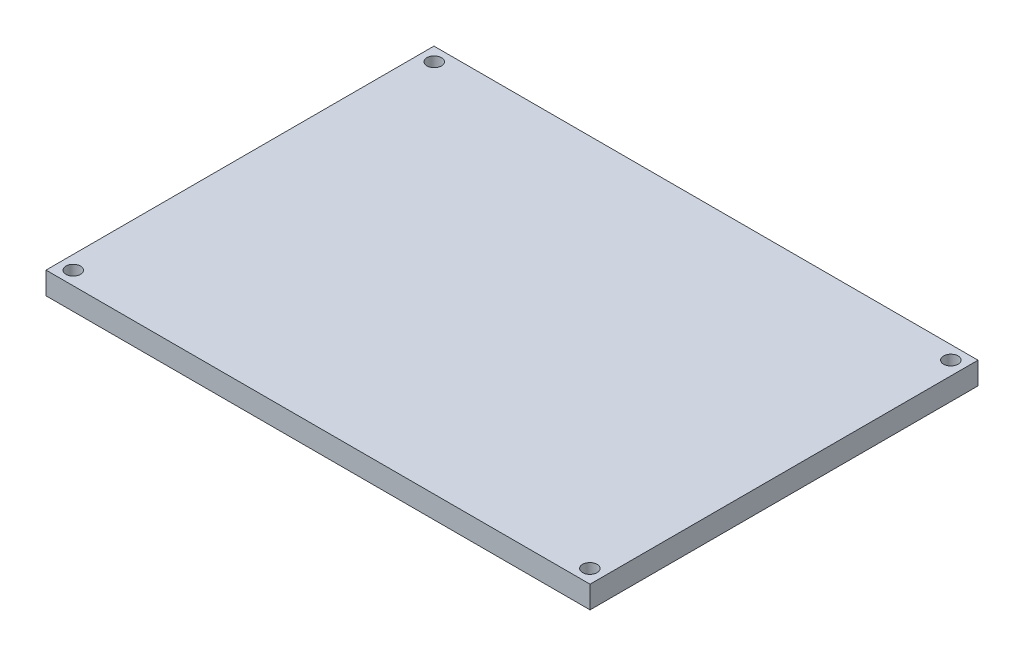
ISO-10303-21;
HEADER;
FILE_DESCRIPTION(('STEP AP214'),'2;1');
FILE_NAME('part.step','',(''),(''),'','','');
FILE_SCHEMA(('AUTOMOTIVE_DESIGN { 1 0 10303 214 1 1 1 1 }'));
ENDSEC;
DATA;
#1=APPLICATION_CONTEXT('core data for automotive mechanical design processes');
#2=APPLICATION_PROTOCOL_DEFINITION('international standard','automotive_design',2000,#1);
#3=PRODUCT_CONTEXT('',#1,'mechanical');
#4=PRODUCT('Part','Part','',(#3));
#5=PRODUCT_RELATED_PRODUCT_CATEGORY('part','',(#4));
#6=PRODUCT_DEFINITION_FORMATION('','',#4);
#7=PRODUCT_DEFINITION_CONTEXT('part definition',#1,'design');
#8=PRODUCT_DEFINITION('design','',#6,#7);
#9=PRODUCT_DEFINITION_SHAPE('','',#8);
#10=(LENGTH_UNIT() NAMED_UNIT(*) SI_UNIT(.MILLI.,.METRE.));
#11=(NAMED_UNIT(*) PLANE_ANGLE_UNIT() SI_UNIT($,.RADIAN.));
#12=(NAMED_UNIT(*) SI_UNIT($,.STERADIAN.) SOLID_ANGLE_UNIT());
#13=UNCERTAINTY_MEASURE_WITH_UNIT(LENGTH_MEASURE(1.E-05),#10,'distance_accuracy_value','');
#14=(GEOMETRIC_REPRESENTATION_CONTEXT(3) GLOBAL_UNCERTAINTY_ASSIGNED_CONTEXT((#13)) GLOBAL_UNIT_ASSIGNED_CONTEXT((#10,
#11,#12)) REPRESENTATION_CONTEXT('',''));
#15=CARTESIAN_POINT('',(0.,0.,0.));
#16=DIRECTION('',(0.,0.,1.));
#17=DIRECTION('',(1.,0.,0.));
#18=AXIS2_PLACEMENT_3D('',#15,#16,#17);
#19=CARTESIAN_POINT('',(0.,5.,0.));
#20=DIRECTION('',(0.,-1.,0.));
#21=DIRECTION('',(0.,0.,-1.));
#22=AXIS2_PLACEMENT_3D('',#19,#20,#21);
#23=PLANE('',#22);
#24=DIRECTION('',(0.,0.,-1.));
#25=VECTOR('',#24,1.);
#26=CARTESIAN_POINT('',(61.,5.,43.5));
#27=LINE('',#26,#25);
#28=CARTESIAN_POINT('',(61.,5.,43.5));
#29=VERTEX_POINT('',#28);
#30=CARTESIAN_POINT('',(61.,5.,-43.5));
#31=VERTEX_POINT('',#30);
#32=EDGE_CURVE('E91',#29,#31,#27,.T.);
#33=ORIENTED_EDGE('',*,*,#32,.T.);
#34=DIRECTION('',(-1.,0.,0.));
#35=VECTOR('',#34,1.);
#36=CARTESIAN_POINT('',(-61.,5.,-43.5));
#37=LINE('',#36,#35);
#38=CARTESIAN_POINT('',(-61.,5.,-43.5));
#39=VERTEX_POINT('',#38);
#40=EDGE_CURVE('E86',#31,#39,#37,.T.);
#41=ORIENTED_EDGE('',*,*,#40,.T.);
#42=DIRECTION('',(0.,0.,1.));
#43=VECTOR('',#42,1.);
#44=CARTESIAN_POINT('',(-61.,5.,43.5));
#45=LINE('',#44,#43);
#46=CARTESIAN_POINT('',(-61.,5.,43.5));
#47=VERTEX_POINT('',#46);
#48=EDGE_CURVE('E89',#39,#47,#45,.T.);
#49=ORIENTED_EDGE('',*,*,#48,.T.);
#50=DIRECTION('',(1.,0.,0.));
#51=VECTOR('',#50,1.);
#52=CARTESIAN_POINT('',(-61.,5.,43.5));
#53=LINE('',#52,#51);
#54=EDGE_CURVE('E56',#47,#29,#53,.T.);
#55=ORIENTED_EDGE('',*,*,#54,.T.);
#56=EDGE_LOOP('',(#33,#41,#49,#55));
#57=FACE_BOUND('',#56,.T.);
#58=CARTESIAN_POINT('',(57.925,5.,-40.475));
#59=DIRECTION('',(0.,1.,0.));
#60=DIRECTION('',(0.,0.,1.));
#61=AXIS2_PLACEMENT_3D('',#58,#59,#60);
#62=CIRCLE('',#61,1.625);
#63=CARTESIAN_POINT('',(57.925,5.,-38.85));
#64=VERTEX_POINT('',#63);
#65=EDGE_CURVE('E106',#64,#64,#62,.T.);
#66=ORIENTED_EDGE('',*,*,#65,.F.);
#67=EDGE_LOOP('',(#66));
#68=FACE_BOUND('',#67,.T.);
#69=CARTESIAN_POINT('',(-57.9250000000003,5.,-40.4749999999996));
#70=DIRECTION('',(0.,1.,0.));
#71=DIRECTION('',(0.,0.,-1.));
#72=AXIS2_PLACEMENT_3D('',#69,#70,#71);
#73=CIRCLE('',#72,1.62500000000002);
#74=CARTESIAN_POINT('',(-57.9250000000003,5.,-42.0999999999996));
#75=VERTEX_POINT('',#74);
#76=EDGE_CURVE('E121',#75,#75,#73,.T.);
#77=ORIENTED_EDGE('',*,*,#76,.F.);
#78=EDGE_LOOP('',(#77));
#79=FACE_BOUND('',#78,.T.);
#80=CARTESIAN_POINT('',(-57.9250000000003,5.,40.4749999999995));
#81=DIRECTION('',(0.,1.,0.));
#82=DIRECTION('',(0.,0.,1.));
#83=AXIS2_PLACEMENT_3D('',#80,#81,#82);
#84=CIRCLE('',#83,1.62500000000002);
#85=CARTESIAN_POINT('',(-57.9250000000003,5.,42.0999999999996));
#86=VERTEX_POINT('',#85);
#87=EDGE_CURVE('E127',#86,#86,#84,.T.);
#88=ORIENTED_EDGE('',*,*,#87,.F.);
#89=EDGE_LOOP('',(#88));
#90=FACE_BOUND('',#89,.T.);
#91=CARTESIAN_POINT('',(57.925,5.,40.475));
#92=DIRECTION('',(0.,1.,0.));
#93=DIRECTION('',(0.,0.,-1.));
#94=AXIS2_PLACEMENT_3D('',#91,#92,#93);
#95=CIRCLE('',#94,1.625);
#96=CARTESIAN_POINT('',(57.925,5.,38.85));
#97=VERTEX_POINT('',#96);
#98=EDGE_CURVE('E133',#97,#97,#95,.T.);
#99=ORIENTED_EDGE('',*,*,#98,.F.);
#100=EDGE_LOOP('',(#99));
#101=FACE_BOUND('',#100,.T.);
#102=ADVANCED_FACE('F39',(#57,#68,#79,#90,#101),#23,.F.);
#103=CARTESIAN_POINT('',(0.,0.,0.));
#104=DIRECTION('',(0.,-1.,0.));
#105=DIRECTION('',(0.,0.,-1.));
#106=AXIS2_PLACEMENT_3D('',#103,#104,#105);
#107=PLANE('',#106);
#108=CARTESIAN_POINT('',(-57.9250000000003,0.,40.4749999999995));
#109=DIRECTION('',(0.,1.,0.));
#110=DIRECTION('',(0.,0.,1.));
#111=AXIS2_PLACEMENT_3D('',#108,#109,#110);
#112=CIRCLE('',#111,1.62500000000002);
#113=CARTESIAN_POINT('',(-57.9250000000003,0.,42.0999999999996));
#114=VERTEX_POINT('',#113);
#115=EDGE_CURVE('E130',#114,#114,#112,.T.);
#116=ORIENTED_EDGE('',*,*,#115,.T.);
#117=EDGE_LOOP('',(#116));
#118=FACE_BOUND('',#117,.T.);
#119=CARTESIAN_POINT('',(57.925,0.,-40.475));
#120=DIRECTION('',(0.,1.,0.));
#121=DIRECTION('',(0.,0.,1.));
#122=AXIS2_PLACEMENT_3D('',#119,#120,#121);
#123=CIRCLE('',#122,1.625);
#124=CARTESIAN_POINT('',(57.925,0.,-38.85));
#125=VERTEX_POINT('',#124);
#126=EDGE_CURVE('E118',#125,#125,#123,.T.);
#127=ORIENTED_EDGE('',*,*,#126,.T.);
#128=EDGE_LOOP('',(#127));
#129=FACE_BOUND('',#128,.T.);
#130=DIRECTION('',(0.,0.,-1.));
#131=VECTOR('',#130,1.);
#132=CARTESIAN_POINT('',(61.,0.,43.5));
#133=LINE('',#132,#131);
#134=CARTESIAN_POINT('',(61.,0.,43.5));
#135=VERTEX_POINT('',#134);
#136=CARTESIAN_POINT('',(61.,0.,-43.5));
#137=VERTEX_POINT('',#136);
#138=EDGE_CURVE('E103',#135,#137,#133,.T.);
#139=ORIENTED_EDGE('',*,*,#138,.F.);
#140=DIRECTION('',(1.,0.,0.));
#141=VECTOR('',#140,1.);
#142=CARTESIAN_POINT('',(-61.,0.,43.5));
#143=LINE('',#142,#141);
#144=CARTESIAN_POINT('',(-61.,0.,43.5));
#145=VERTEX_POINT('',#144);
#146=EDGE_CURVE('E79',#145,#135,#143,.T.);
#147=ORIENTED_EDGE('',*,*,#146,.F.);
#148=DIRECTION('',(0.,0.,1.));
#149=VECTOR('',#148,1.);
#150=CARTESIAN_POINT('',(-61.,0.,43.5));
#151=LINE('',#150,#149);
#152=CARTESIAN_POINT('',(-61.,0.,-43.5));
#153=VERTEX_POINT('',#152);
#154=EDGE_CURVE('E73',#153,#145,#151,.T.);
#155=ORIENTED_EDGE('',*,*,#154,.F.);
#156=DIRECTION('',(-1.,0.,0.));
#157=VECTOR('',#156,1.);
#158=CARTESIAN_POINT('',(-61.,0.,-43.5));
#159=LINE('',#158,#157);
#160=EDGE_CURVE('E95',#137,#153,#159,.T.);
#161=ORIENTED_EDGE('',*,*,#160,.F.);
#162=EDGE_LOOP('',(#139,#147,#155,#161));
#163=FACE_BOUND('',#162,.T.);
#164=CARTESIAN_POINT('',(-57.9250000000003,0.,-40.4749999999996));
#165=DIRECTION('',(0.,1.,0.));
#166=DIRECTION('',(0.,0.,-1.));
#167=AXIS2_PLACEMENT_3D('',#164,#165,#166);
#168=CIRCLE('',#167,1.62500000000002);
#169=CARTESIAN_POINT('',(-57.9250000000003,0.,-42.0999999999996));
#170=VERTEX_POINT('',#169);
#171=EDGE_CURVE('E124',#170,#170,#168,.T.);
#172=ORIENTED_EDGE('',*,*,#171,.T.);
#173=EDGE_LOOP('',(#172));
#174=FACE_BOUND('',#173,.T.);
#175=CARTESIAN_POINT('',(57.925,0.,40.475));
#176=DIRECTION('',(0.,1.,0.));
#177=DIRECTION('',(0.,0.,-1.));
#178=AXIS2_PLACEMENT_3D('',#175,#176,#177);
#179=CIRCLE('',#178,1.625);
#180=CARTESIAN_POINT('',(57.925,0.,38.85));
#181=VERTEX_POINT('',#180);
#182=EDGE_CURVE('E136',#181,#181,#179,.T.);
#183=ORIENTED_EDGE('',*,*,#182,.T.);
#184=EDGE_LOOP('',(#183));
#185=FACE_BOUND('',#184,.T.);
#186=ADVANCED_FACE('F114',(#118,#129,#163,#174,#185),#107,.T.);
#187=CARTESIAN_POINT('',(61.,5.,43.5));
#188=DIRECTION('',(-1.,0.,0.));
#189=DIRECTION('',(0.,0.,1.));
#190=AXIS2_PLACEMENT_3D('',#187,#188,#189);
#191=PLANE('',#190);
#192=ORIENTED_EDGE('',*,*,#138,.T.);
#193=DIRECTION('',(0.,-1.,0.));
#194=VECTOR('',#193,1.);
#195=CARTESIAN_POINT('',(61.,5.,-43.5));
#196=LINE('',#195,#194);
#197=EDGE_CURVE('E11',#31,#137,#196,.T.);
#198=ORIENTED_EDGE('',*,*,#197,.F.);
#199=ORIENTED_EDGE('',*,*,#32,.F.);
#200=DIRECTION('',(0.,-1.,0.));
#201=VECTOR('',#200,1.);
#202=CARTESIAN_POINT('',(61.,5.,43.5));
#203=LINE('',#202,#201);
#204=EDGE_CURVE('E99',#29,#135,#203,.T.);
#205=ORIENTED_EDGE('',*,*,#204,.T.);
#206=EDGE_LOOP('',(#192,#198,#199,#205));
#207=FACE_BOUND('',#206,.T.);
#208=ADVANCED_FACE('F41',(#207),#191,.F.);
#209=CARTESIAN_POINT('',(-61.,5.,-43.5));
#210=DIRECTION('',(0.,0.,1.));
#211=DIRECTION('',(1.,0.,0.));
#212=AXIS2_PLACEMENT_3D('',#209,#210,#211);
#213=PLANE('',#212);
#214=ORIENTED_EDGE('',*,*,#160,.T.);
#215=DIRECTION('',(0.,-1.,0.));
#216=VECTOR('',#215,1.);
#217=CARTESIAN_POINT('',(-61.,5.,-43.5));
#218=LINE('',#217,#216);
#219=EDGE_CURVE('E48',#39,#153,#218,.T.);
#220=ORIENTED_EDGE('',*,*,#219,.F.);
#221=ORIENTED_EDGE('',*,*,#40,.F.);
#222=ORIENTED_EDGE('',*,*,#197,.T.);
#223=EDGE_LOOP('',(#214,#220,#221,#222));
#224=FACE_BOUND('',#223,.T.);
#225=ADVANCED_FACE('F94',(#224),#213,.F.);
#226=CARTESIAN_POINT('',(-61.,5.,43.5));
#227=DIRECTION('',(1.,0.,0.));
#228=DIRECTION('',(0.,0.,-1.));
#229=AXIS2_PLACEMENT_3D('',#226,#227,#228);
#230=PLANE('',#229);
#231=ORIENTED_EDGE('',*,*,#154,.T.);
#232=DIRECTION('',(0.,-1.,0.));
#233=VECTOR('',#232,1.);
#234=CARTESIAN_POINT('',(-61.,5.,43.5));
#235=LINE('',#234,#233);
#236=EDGE_CURVE('E96',#47,#145,#235,.T.);
#237=ORIENTED_EDGE('',*,*,#236,.F.);
#238=ORIENTED_EDGE('',*,*,#48,.F.);
#239=ORIENTED_EDGE('',*,*,#219,.T.);
#240=EDGE_LOOP('',(#231,#237,#238,#239));
#241=FACE_BOUND('',#240,.T.);
#242=ADVANCED_FACE('F97',(#241),#230,.F.);
#243=CARTESIAN_POINT('',(-61.,5.,43.5));
#244=DIRECTION('',(0.,0.,-1.));
#245=DIRECTION('',(-1.,0.,0.));
#246=AXIS2_PLACEMENT_3D('',#243,#244,#245);
#247=PLANE('',#246);
#248=ORIENTED_EDGE('',*,*,#146,.T.);
#249=ORIENTED_EDGE('',*,*,#204,.F.);
#250=ORIENTED_EDGE('',*,*,#54,.F.);
#251=ORIENTED_EDGE('',*,*,#236,.T.);
#252=EDGE_LOOP('',(#248,#249,#250,#251));
#253=FACE_BOUND('',#252,.T.);
#254=ADVANCED_FACE('F111',(#253),#247,.F.);
#255=CARTESIAN_POINT('',(57.925,5.,-40.475));
#256=DIRECTION('',(0.,-1.,0.));
#257=DIRECTION('',(0.,0.,-1.));
#258=AXIS2_PLACEMENT_3D('',#255,#256,#257);
#259=CYLINDRICAL_SURFACE('',#258,1.625);
#260=ORIENTED_EDGE('',*,*,#65,.T.);
#261=EDGE_LOOP('',(#260));
#262=FACE_BOUND('',#261,.T.);
#263=ORIENTED_EDGE('',*,*,#126,.F.);
#264=EDGE_LOOP('',(#263));
#265=FACE_BOUND('',#264,.T.);
#266=ADVANCED_FACE('F153',(#262,#265),#259,.F.);
#267=CARTESIAN_POINT('',(-57.9250000000003,5.,-40.4749999999996));
#268=DIRECTION('',(0.,-1.,0.));
#269=DIRECTION('',(0.,0.,-1.));
#270=AXIS2_PLACEMENT_3D('',#267,#268,#269);
#271=CYLINDRICAL_SURFACE('',#270,1.62500000000002);
#272=ORIENTED_EDGE('',*,*,#76,.T.);
#273=EDGE_LOOP('',(#272));
#274=FACE_BOUND('',#273,.T.);
#275=ORIENTED_EDGE('',*,*,#171,.F.);
#276=EDGE_LOOP('',(#275));
#277=FACE_BOUND('',#276,.T.);
#278=ADVANCED_FACE('F198',(#274,#277),#271,.F.);
#279=CARTESIAN_POINT('',(-57.9250000000003,5.,40.4749999999995));
#280=DIRECTION('',(0.,-1.,0.));
#281=DIRECTION('',(0.,0.,-1.));
#282=AXIS2_PLACEMENT_3D('',#279,#280,#281);
#283=CYLINDRICAL_SURFACE('',#282,1.62500000000002);
#284=ORIENTED_EDGE('',*,*,#87,.T.);
#285=EDGE_LOOP('',(#284));
#286=FACE_BOUND('',#285,.T.);
#287=ORIENTED_EDGE('',*,*,#115,.F.);
#288=EDGE_LOOP('',(#287));
#289=FACE_BOUND('',#288,.T.);
#290=ADVANCED_FACE('F206',(#286,#289),#283,.F.);
#291=CARTESIAN_POINT('',(57.925,5.,40.475));
#292=DIRECTION('',(0.,-1.,0.));
#293=DIRECTION('',(0.,0.,-1.));
#294=AXIS2_PLACEMENT_3D('',#291,#292,#293);
#295=CYLINDRICAL_SURFACE('',#294,1.625);
#296=ORIENTED_EDGE('',*,*,#98,.T.);
#297=EDGE_LOOP('',(#296));
#298=FACE_BOUND('',#297,.T.);
#299=ORIENTED_EDGE('',*,*,#182,.F.);
#300=EDGE_LOOP('',(#299));
#301=FACE_BOUND('',#300,.T.);
#302=ADVANCED_FACE('F142',(#298,#301),#295,.F.);
#303=CLOSED_SHELL('',(#102,#186,#208,#225,#242,#254,#266,#278,#290,#302));
#304=MANIFOLD_SOLID_BREP('B2',#303);
#305=ADVANCED_BREP_SHAPE_REPRESENTATION('',(#18,#304),#14);
#306=SHAPE_DEFINITION_REPRESENTATION(#9,#305);
ENDSEC;
END-ISO-10303-21;
